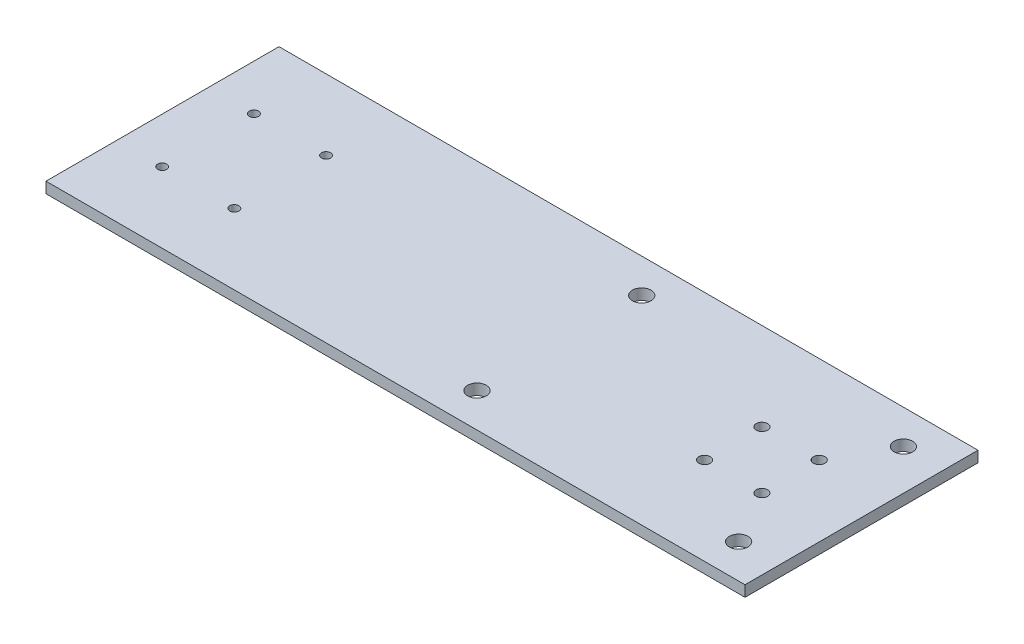
ISO-10303-21;
HEADER;
FILE_DESCRIPTION(('STEP AP214'),'2;1');
FILE_NAME('part.step','',(''),(''),'','','');
FILE_SCHEMA(('AUTOMOTIVE_DESIGN { 1 0 10303 214 1 1 1 1 }'));
ENDSEC;
DATA;
#1=APPLICATION_CONTEXT('core data for automotive mechanical design processes');
#2=APPLICATION_PROTOCOL_DEFINITION('international standard','automotive_design',2000,#1);
#3=PRODUCT_CONTEXT('',#1,'mechanical');
#4=PRODUCT('Part','Part','',(#3));
#5=PRODUCT_RELATED_PRODUCT_CATEGORY('part','',(#4));
#6=PRODUCT_DEFINITION_FORMATION('','',#4);
#7=PRODUCT_DEFINITION_CONTEXT('part definition',#1,'design');
#8=PRODUCT_DEFINITION('design','',#6,#7);
#9=PRODUCT_DEFINITION_SHAPE('','',#8);
#10=(LENGTH_UNIT() NAMED_UNIT(*) SI_UNIT(.MILLI.,.METRE.));
#11=(NAMED_UNIT(*) PLANE_ANGLE_UNIT() SI_UNIT($,.RADIAN.));
#12=(NAMED_UNIT(*) SI_UNIT($,.STERADIAN.) SOLID_ANGLE_UNIT());
#13=UNCERTAINTY_MEASURE_WITH_UNIT(LENGTH_MEASURE(1.E-05),#10,'distance_accuracy_value','');
#14=(GEOMETRIC_REPRESENTATION_CONTEXT(3) GLOBAL_UNCERTAINTY_ASSIGNED_CONTEXT((#13)) GLOBAL_UNIT_ASSIGNED_CONTEXT((#10,
#11,#12)) REPRESENTATION_CONTEXT('',''));
#15=CARTESIAN_POINT('',(0.,0.,0.));
#16=DIRECTION('',(0.,0.,1.));
#17=DIRECTION('',(1.,0.,0.));
#18=AXIS2_PLACEMENT_3D('',#15,#16,#17);
#19=CARTESIAN_POINT('',(0.,4.7625,0.));
#20=DIRECTION('',(0.,-1.,0.));
#21=DIRECTION('',(0.,0.,-1.));
#22=AXIS2_PLACEMENT_3D('',#19,#20,#21);
#23=PLANE('',#22);
#24=DIRECTION('',(1.,0.,0.));
#25=VECTOR('',#24,1.);
#26=CARTESIAN_POINT('',(304.8,4.7625,-25.4));
#27=LINE('',#26,#25);
#28=CARTESIAN_POINT('',(0.,4.7625,-25.4));
#29=VERTEX_POINT('',#28);
#30=CARTESIAN_POINT('',(304.8,4.7625,-25.4));
#31=VERTEX_POINT('',#30);
#32=EDGE_CURVE('E86',#29,#31,#27,.T.);
#33=ORIENTED_EDGE('',*,*,#32,.T.);
#34=DIRECTION('',(0.,0.,-1.));
#35=VECTOR('',#34,1.);
#36=CARTESIAN_POINT('',(304.8,4.7625,-127.));
#37=LINE('',#36,#35);
#38=CARTESIAN_POINT('',(304.8,4.7625,-127.));
#39=VERTEX_POINT('',#38);
#40=EDGE_CURVE('E81',#31,#39,#37,.T.);
#41=ORIENTED_EDGE('',*,*,#40,.T.);
#42=DIRECTION('',(-1.,0.,0.));
#43=VECTOR('',#42,1.);
#44=CARTESIAN_POINT('',(0.,4.7625,-127.));
#45=LINE('',#44,#43);
#46=CARTESIAN_POINT('',(0.,4.7625,-127.));
#47=VERTEX_POINT('',#46);
#48=EDGE_CURVE('E84',#39,#47,#45,.T.);
#49=ORIENTED_EDGE('',*,*,#48,.T.);
#50=DIRECTION('',(0.,0.,1.));
#51=VECTOR('',#50,1.);
#52=CARTESIAN_POINT('',(0.,4.7625,-25.4));
#53=LINE('',#52,#51);
#54=EDGE_CURVE('E51',#47,#29,#53,.T.);
#55=ORIENTED_EDGE('',*,*,#54,.T.);
#56=EDGE_LOOP('',(#33,#41,#49,#55));
#57=FACE_BOUND('',#56,.T.);
#58=CARTESIAN_POINT('',(248.864414399119,4.7625,-88.7000000000002));
#59=DIRECTION('',(0.,1.,0.));
#60=DIRECTION('',(0.,0.,1.));
#61=AXIS2_PLACEMENT_3D('',#58,#59,#60);
#62=CIRCLE('',#61,2.49999999999995);
#63=CARTESIAN_POINT('',(248.864414399119,4.7625,-86.2000000000002));
#64=VERTEX_POINT('',#63);
#65=EDGE_CURVE('E101',#64,#64,#62,.T.);
#66=ORIENTED_EDGE('',*,*,#65,.F.);
#67=EDGE_LOOP('',(#66));
#68=FACE_BOUND('',#67,.T.);
#69=CARTESIAN_POINT('',(248.864414399121,4.7625,-63.6999999999932));
#70=DIRECTION('',(0.,1.,0.));
#71=DIRECTION('',(0.,0.,1.));
#72=AXIS2_PLACEMENT_3D('',#69,#70,#71);
#73=CIRCLE('',#72,2.49999999999283);
#74=CARTESIAN_POINT('',(248.864414399121,4.7625,-61.2000000000004));
#75=VERTEX_POINT('',#74);
#76=EDGE_CURVE('E116',#75,#75,#73,.T.);
#77=ORIENTED_EDGE('',*,*,#76,.F.);
#78=EDGE_LOOP('',(#77));
#79=FACE_BOUND('',#78,.T.);
#80=CARTESIAN_POINT('',(273.864414399119,4.7625,-63.6999999999998));
#81=DIRECTION('',(0.,1.,0.));
#82=DIRECTION('',(0.,0.,1.));
#83=AXIS2_PLACEMENT_3D('',#80,#81,#82);
#84=CIRCLE('',#83,2.49999999999995);
#85=CARTESIAN_POINT('',(273.864414399119,4.7625,-61.1999999999999));
#86=VERTEX_POINT('',#85);
#87=EDGE_CURVE('E122',#86,#86,#84,.T.);
#88=ORIENTED_EDGE('',*,*,#87,.F.);
#89=EDGE_LOOP('',(#88));
#90=FACE_BOUND('',#89,.T.);
#91=CARTESIAN_POINT('',(273.864414399123,4.7625,-88.6999999999959));
#92=DIRECTION('',(0.,1.,0.));
#93=DIRECTION('',(0.,0.,1.));
#94=AXIS2_PLACEMENT_3D('',#91,#92,#93);
#95=CIRCLE('',#94,2.50000000000428);
#96=CARTESIAN_POINT('',(273.864414399123,4.7625,-86.1999999999916));
#97=VERTEX_POINT('',#96);
#98=EDGE_CURVE('E128',#97,#97,#95,.T.);
#99=ORIENTED_EDGE('',*,*,#98,.F.);
#100=EDGE_LOOP('',(#99));
#101=FACE_BOUND('',#100,.T.);
#102=CARTESIAN_POINT('',(287.143048189962,4.7625,-40.2828125));
#103=DIRECTION('',(0.,1.,0.));
#104=DIRECTION('',(0.,0.,1.));
#105=AXIS2_PLACEMENT_3D('',#102,#103,#104);
#106=CIRCLE('',#105,4.04999999999998);
#107=CARTESIAN_POINT('',(287.143048189962,4.7625,-36.2328125));
#108=VERTEX_POINT('',#107);
#109=EDGE_CURVE('E134',#108,#108,#106,.T.);
#110=ORIENTED_EDGE('',*,*,#109,.F.);
#111=EDGE_LOOP('',(#110));
#112=FACE_BOUND('',#111,.T.);
#113=CARTESIAN_POINT('',(173.042404906379,4.7625,-40.2828125));
#114=DIRECTION('',(0.,1.,0.));
#115=DIRECTION('',(0.,0.,1.));
#116=AXIS2_PLACEMENT_3D('',#113,#114,#115);
#117=CIRCLE('',#116,4.05);
#118=CARTESIAN_POINT('',(173.042404906379,4.7625,-36.2328125));
#119=VERTEX_POINT('',#118);
#120=EDGE_CURVE('E140',#119,#119,#117,.T.);
#121=ORIENTED_EDGE('',*,*,#120,.F.);
#122=EDGE_LOOP('',(#121));
#123=FACE_BOUND('',#122,.T.);
#124=CARTESIAN_POINT('',(173.042404906379,4.7625,-112.1171875));
#125=DIRECTION('',(0.,1.,0.));
#126=DIRECTION('',(0.,0.,1.));
#127=AXIS2_PLACEMENT_3D('',#124,#125,#126);
#128=CIRCLE('',#127,4.04999999999999);
#129=CARTESIAN_POINT('',(173.042404906379,4.7625,-108.0671875));
#130=VERTEX_POINT('',#129);
#131=EDGE_CURVE('E146',#130,#130,#128,.T.);
#132=ORIENTED_EDGE('',*,*,#131,.F.);
#133=EDGE_LOOP('',(#132));
#134=FACE_BOUND('',#133,.T.);
#135=CARTESIAN_POINT('',(287.143048189962,4.7625,-112.1171875));
#136=DIRECTION('',(0.,1.,0.));
#137=DIRECTION('',(0.,0.,1.));
#138=AXIS2_PLACEMENT_3D('',#135,#136,#137);
#139=CIRCLE('',#138,4.05);
#140=CARTESIAN_POINT('',(287.143048189962,4.7625,-108.0671875));
#141=VERTEX_POINT('',#140);
#142=EDGE_CURVE('E152',#141,#141,#139,.T.);
#143=ORIENTED_EDGE('',*,*,#142,.F.);
#144=EDGE_LOOP('',(#143));
#145=FACE_BOUND('',#144,.T.);
#146=CARTESIAN_POINT('',(19.876076597086,4.7625,-56.20004));
#147=DIRECTION('',(0.,1.,0.));
#148=DIRECTION('',(0.,0.,1.));
#149=AXIS2_PLACEMENT_3D('',#146,#147,#148);
#150=CIRCLE('',#149,2.);
#151=CARTESIAN_POINT('',(19.876076597086,4.7625,-54.20004));
#152=VERTEX_POINT('',#151);
#153=EDGE_CURVE('E158',#152,#152,#150,.T.);
#154=ORIENTED_EDGE('',*,*,#153,.F.);
#155=EDGE_LOOP('',(#154));
#156=FACE_BOUND('',#155,.T.);
#157=CARTESIAN_POINT('',(51.3288001481484,4.7625,-56.20004));
#158=DIRECTION('',(0.,1.,0.));
#159=DIRECTION('',(0.,0.,1.));
#160=AXIS2_PLACEMENT_3D('',#157,#158,#159);
#161=CIRCLE('',#160,2.);
#162=CARTESIAN_POINT('',(51.3288001481484,4.7625,-54.20004));
#163=VERTEX_POINT('',#162);
#164=EDGE_CURVE('E164',#163,#163,#161,.T.);
#165=ORIENTED_EDGE('',*,*,#164,.F.);
#166=EDGE_LOOP('',(#165));
#167=FACE_BOUND('',#166,.T.);
#168=CARTESIAN_POINT('',(51.3288001481484,4.7625,-96.19996));
#169=DIRECTION('',(0.,1.,0.));
#170=DIRECTION('',(0.,0.,1.));
#171=AXIS2_PLACEMENT_3D('',#168,#169,#170);
#172=CIRCLE('',#171,2.);
#173=CARTESIAN_POINT('',(51.3288001481484,4.7625,-94.19996));
#174=VERTEX_POINT('',#173);
#175=EDGE_CURVE('E170',#174,#174,#172,.T.);
#176=ORIENTED_EDGE('',*,*,#175,.F.);
#177=EDGE_LOOP('',(#176));
#178=FACE_BOUND('',#177,.T.);
#179=CARTESIAN_POINT('',(19.876076597086,4.7625,-96.19996));
#180=DIRECTION('',(0.,1.,0.));
#181=DIRECTION('',(0.,0.,1.));
#182=AXIS2_PLACEMENT_3D('',#179,#180,#181);
#183=CIRCLE('',#182,2.);
#184=CARTESIAN_POINT('',(19.876076597086,4.7625,-94.19996));
#185=VERTEX_POINT('',#184);
#186=EDGE_CURVE('E176',#185,#185,#183,.T.);
#187=ORIENTED_EDGE('',*,*,#186,.F.);
#188=EDGE_LOOP('',(#187));
#189=FACE_BOUND('',#188,.T.);
#190=ADVANCED_FACE('F34',(#57,#68,#79,#90,#101,#112,#123,#134,#145,#156,#167,#178,#189),#23,.F.);
#191=CARTESIAN_POINT('',(0.,0.,0.));
#192=DIRECTION('',(0.,-1.,0.));
#193=DIRECTION('',(0.,0.,-1.));
#194=AXIS2_PLACEMENT_3D('',#191,#192,#193);
#195=PLANE('',#194);
#196=CARTESIAN_POINT('',(51.3288001481484,0.,-96.19996));
#197=DIRECTION('',(0.,1.,0.));
#198=DIRECTION('',(0.,0.,1.));
#199=AXIS2_PLACEMENT_3D('',#196,#197,#198);
#200=CIRCLE('',#199,2.);
#201=CARTESIAN_POINT('',(51.3288001481484,0.,-94.19996));
#202=VERTEX_POINT('',#201);
#203=EDGE_CURVE('E173',#202,#202,#200,.T.);
#204=ORIENTED_EDGE('',*,*,#203,.T.);
#205=EDGE_LOOP('',(#204));
#206=FACE_BOUND('',#205,.T.);
#207=CARTESIAN_POINT('',(19.876076597086,0.,-56.20004));
#208=DIRECTION('',(0.,1.,0.));
#209=DIRECTION('',(0.,0.,1.));
#210=AXIS2_PLACEMENT_3D('',#207,#208,#209);
#211=CIRCLE('',#210,2.);
#212=CARTESIAN_POINT('',(19.876076597086,0.,-54.20004));
#213=VERTEX_POINT('',#212);
#214=EDGE_CURVE('E161',#213,#213,#211,.T.);
#215=ORIENTED_EDGE('',*,*,#214,.T.);
#216=EDGE_LOOP('',(#215));
#217=FACE_BOUND('',#216,.T.);
#218=CARTESIAN_POINT('',(173.042404906379,0.,-112.1171875));
#219=DIRECTION('',(0.,1.,0.));
#220=DIRECTION('',(0.,0.,1.));
#221=AXIS2_PLACEMENT_3D('',#218,#219,#220);
#222=CIRCLE('',#221,4.04999999999999);
#223=CARTESIAN_POINT('',(173.042404906379,0.,-108.0671875));
#224=VERTEX_POINT('',#223);
#225=EDGE_CURVE('E149',#224,#224,#222,.T.);
#226=ORIENTED_EDGE('',*,*,#225,.T.);
#227=EDGE_LOOP('',(#226));
#228=FACE_BOUND('',#227,.T.);
#229=CARTESIAN_POINT('',(287.143048189962,0.,-40.2828125));
#230=DIRECTION('',(0.,1.,0.));
#231=DIRECTION('',(0.,0.,1.));
#232=AXIS2_PLACEMENT_3D('',#229,#230,#231);
#233=CIRCLE('',#232,4.04999999999998);
#234=CARTESIAN_POINT('',(287.143048189962,0.,-36.2328125));
#235=VERTEX_POINT('',#234);
#236=EDGE_CURVE('E137',#235,#235,#233,.T.);
#237=ORIENTED_EDGE('',*,*,#236,.T.);
#238=EDGE_LOOP('',(#237));
#239=FACE_BOUND('',#238,.T.);
#240=CARTESIAN_POINT('',(273.864414399119,0.,-63.6999999999998));
#241=DIRECTION('',(0.,1.,0.));
#242=DIRECTION('',(0.,0.,1.));
#243=AXIS2_PLACEMENT_3D('',#240,#241,#242);
#244=CIRCLE('',#243,2.49999999999995);
#245=CARTESIAN_POINT('',(273.864414399119,0.,-61.1999999999999));
#246=VERTEX_POINT('',#245);
#247=EDGE_CURVE('E125',#246,#246,#244,.T.);
#248=ORIENTED_EDGE('',*,*,#247,.T.);
#249=EDGE_LOOP('',(#248));
#250=FACE_BOUND('',#249,.T.);
#251=CARTESIAN_POINT('',(248.864414399119,0.,-88.7000000000002));
#252=DIRECTION('',(0.,1.,0.));
#253=DIRECTION('',(0.,0.,1.));
#254=AXIS2_PLACEMENT_3D('',#251,#252,#253);
#255=CIRCLE('',#254,2.49999999999995);
#256=CARTESIAN_POINT('',(248.864414399119,0.,-86.2000000000002));
#257=VERTEX_POINT('',#256);
#258=EDGE_CURVE('E113',#257,#257,#255,.T.);
#259=ORIENTED_EDGE('',*,*,#258,.T.);
#260=EDGE_LOOP('',(#259));
#261=FACE_BOUND('',#260,.T.);
#262=DIRECTION('',(1.,0.,0.));
#263=VECTOR('',#262,1.);
#264=CARTESIAN_POINT('',(304.8,0.,-25.4));
#265=LINE('',#264,#263);
#266=CARTESIAN_POINT('',(0.,0.,-25.4));
#267=VERTEX_POINT('',#266);
#268=CARTESIAN_POINT('',(304.8,0.,-25.4));
#269=VERTEX_POINT('',#268);
#270=EDGE_CURVE('E98',#267,#269,#265,.T.);
#271=ORIENTED_EDGE('',*,*,#270,.F.);
#272=DIRECTION('',(0.,0.,1.));
#273=VECTOR('',#272,1.);
#274=CARTESIAN_POINT('',(0.,0.,-25.4));
#275=LINE('',#274,#273);
#276=CARTESIAN_POINT('',(0.,0.,-127.));
#277=VERTEX_POINT('',#276);
#278=EDGE_CURVE('E74',#277,#267,#275,.T.);
#279=ORIENTED_EDGE('',*,*,#278,.F.);
#280=DIRECTION('',(-1.,0.,0.));
#281=VECTOR('',#280,1.);
#282=CARTESIAN_POINT('',(0.,0.,-127.));
#283=LINE('',#282,#281);
#284=CARTESIAN_POINT('',(304.8,0.,-127.));
#285=VERTEX_POINT('',#284);
#286=EDGE_CURVE('E68',#285,#277,#283,.T.);
#287=ORIENTED_EDGE('',*,*,#286,.F.);
#288=DIRECTION('',(0.,0.,-1.));
#289=VECTOR('',#288,1.);
#290=CARTESIAN_POINT('',(304.8,0.,-127.));
#291=LINE('',#290,#289);
#292=EDGE_CURVE('E90',#269,#285,#291,.T.);
#293=ORIENTED_EDGE('',*,*,#292,.F.);
#294=EDGE_LOOP('',(#271,#279,#287,#293));
#295=FACE_BOUND('',#294,.T.);
#296=CARTESIAN_POINT('',(248.864414399121,0.,-63.6999999999932));
#297=DIRECTION('',(0.,1.,0.));
#298=DIRECTION('',(0.,0.,1.));
#299=AXIS2_PLACEMENT_3D('',#296,#297,#298);
#300=CIRCLE('',#299,2.49999999999283);
#301=CARTESIAN_POINT('',(248.864414399121,0.,-61.2000000000004));
#302=VERTEX_POINT('',#301);
#303=EDGE_CURVE('E119',#302,#302,#300,.T.);
#304=ORIENTED_EDGE('',*,*,#303,.T.);
#305=EDGE_LOOP('',(#304));
#306=FACE_BOUND('',#305,.T.);
#307=CARTESIAN_POINT('',(273.864414399123,0.,-88.6999999999959));
#308=DIRECTION('',(0.,1.,0.));
#309=DIRECTION('',(0.,0.,1.));
#310=AXIS2_PLACEMENT_3D('',#307,#308,#309);
#311=CIRCLE('',#310,2.50000000000428);
#312=CARTESIAN_POINT('',(273.864414399123,0.,-86.1999999999916));
#313=VERTEX_POINT('',#312);
#314=EDGE_CURVE('E131',#313,#313,#311,.T.);
#315=ORIENTED_EDGE('',*,*,#314,.T.);
#316=EDGE_LOOP('',(#315));
#317=FACE_BOUND('',#316,.T.);
#318=CARTESIAN_POINT('',(173.042404906379,0.,-40.2828125));
#319=DIRECTION('',(0.,1.,0.));
#320=DIRECTION('',(0.,0.,1.));
#321=AXIS2_PLACEMENT_3D('',#318,#319,#320);
#322=CIRCLE('',#321,4.05);
#323=CARTESIAN_POINT('',(173.042404906379,0.,-36.2328125));
#324=VERTEX_POINT('',#323);
#325=EDGE_CURVE('E143',#324,#324,#322,.T.);
#326=ORIENTED_EDGE('',*,*,#325,.T.);
#327=EDGE_LOOP('',(#326));
#328=FACE_BOUND('',#327,.T.);
#329=CARTESIAN_POINT('',(287.143048189962,0.,-112.1171875));
#330=DIRECTION('',(0.,1.,0.));
#331=DIRECTION('',(0.,0.,1.));
#332=AXIS2_PLACEMENT_3D('',#329,#330,#331);
#333=CIRCLE('',#332,4.05);
#334=CARTESIAN_POINT('',(287.143048189962,0.,-108.0671875));
#335=VERTEX_POINT('',#334);
#336=EDGE_CURVE('E155',#335,#335,#333,.T.);
#337=ORIENTED_EDGE('',*,*,#336,.T.);
#338=EDGE_LOOP('',(#337));
#339=FACE_BOUND('',#338,.T.);
#340=CARTESIAN_POINT('',(51.3288001481484,0.,-56.20004));
#341=DIRECTION('',(0.,1.,0.));
#342=DIRECTION('',(0.,0.,1.));
#343=AXIS2_PLACEMENT_3D('',#340,#341,#342);
#344=CIRCLE('',#343,2.);
#345=CARTESIAN_POINT('',(51.3288001481484,0.,-54.20004));
#346=VERTEX_POINT('',#345);
#347=EDGE_CURVE('E167',#346,#346,#344,.T.);
#348=ORIENTED_EDGE('',*,*,#347,.T.);
#349=EDGE_LOOP('',(#348));
#350=FACE_BOUND('',#349,.T.);
#351=CARTESIAN_POINT('',(19.876076597086,0.,-96.19996));
#352=DIRECTION('',(0.,1.,0.));
#353=DIRECTION('',(0.,0.,1.));
#354=AXIS2_PLACEMENT_3D('',#351,#352,#353);
#355=CIRCLE('',#354,2.);
#356=CARTESIAN_POINT('',(19.876076597086,0.,-94.19996));
#357=VERTEX_POINT('',#356);
#358=EDGE_CURVE('E179',#357,#357,#355,.T.);
#359=ORIENTED_EDGE('',*,*,#358,.T.);
#360=EDGE_LOOP('',(#359));
#361=FACE_BOUND('',#360,.T.);
#362=ADVANCED_FACE('F109',(#206,#217,#228,#239,#250,#261,#295,#306,#317,#328,#339,#350,#361),
#195,.T.);
#363=CARTESIAN_POINT('',(304.8,4.7625,-25.4));
#364=DIRECTION('',(0.,0.,-1.));
#365=DIRECTION('',(-1.,0.,0.));
#366=AXIS2_PLACEMENT_3D('',#363,#364,#365);
#367=PLANE('',#366);
#368=ORIENTED_EDGE('',*,*,#270,.T.);
#369=DIRECTION('',(0.,-1.,0.));
#370=VECTOR('',#369,1.);
#371=CARTESIAN_POINT('',(304.8,4.7625,-25.4));
#372=LINE('',#371,#370);
#373=EDGE_CURVE('E11',#31,#269,#372,.T.);
#374=ORIENTED_EDGE('',*,*,#373,.F.);
#375=ORIENTED_EDGE('',*,*,#32,.F.);
#376=DIRECTION('',(0.,-1.,0.));
#377=VECTOR('',#376,1.);
#378=CARTESIAN_POINT('',(0.,4.7625,-25.4));
#379=LINE('',#378,#377);
#380=EDGE_CURVE('E94',#29,#267,#379,.T.);
#381=ORIENTED_EDGE('',*,*,#380,.T.);
#382=EDGE_LOOP('',(#368,#374,#375,#381));
#383=FACE_BOUND('',#382,.T.);
#384=ADVANCED_FACE('F36',(#383),#367,.F.);
#385=CARTESIAN_POINT('',(304.8,4.7625,-127.));
#386=DIRECTION('',(-1.,0.,0.));
#387=DIRECTION('',(0.,0.,1.));
#388=AXIS2_PLACEMENT_3D('',#385,#386,#387);
#389=PLANE('',#388);
#390=ORIENTED_EDGE('',*,*,#292,.T.);
#391=DIRECTION('',(0.,-1.,0.));
#392=VECTOR('',#391,1.);
#393=CARTESIAN_POINT('',(304.8,4.7625,-127.));
#394=LINE('',#393,#392);
#395=EDGE_CURVE('E43',#39,#285,#394,.T.);
#396=ORIENTED_EDGE('',*,*,#395,.F.);
#397=ORIENTED_EDGE('',*,*,#40,.F.);
#398=ORIENTED_EDGE('',*,*,#373,.T.);
#399=EDGE_LOOP('',(#390,#396,#397,#398));
#400=FACE_BOUND('',#399,.T.);
#401=ADVANCED_FACE('F89',(#400),#389,.F.);
#402=CARTESIAN_POINT('',(0.,4.7625,-127.));
#403=DIRECTION('',(0.,0.,1.));
#404=DIRECTION('',(1.,0.,0.));
#405=AXIS2_PLACEMENT_3D('',#402,#403,#404);
#406=PLANE('',#405);
#407=ORIENTED_EDGE('',*,*,#286,.T.);
#408=DIRECTION('',(0.,-1.,0.));
#409=VECTOR('',#408,1.);
#410=CARTESIAN_POINT('',(0.,4.7625,-127.));
#411=LINE('',#410,#409);
#412=EDGE_CURVE('E91',#47,#277,#411,.T.);
#413=ORIENTED_EDGE('',*,*,#412,.F.);
#414=ORIENTED_EDGE('',*,*,#48,.F.);
#415=ORIENTED_EDGE('',*,*,#395,.T.);
#416=EDGE_LOOP('',(#407,#413,#414,#415));
#417=FACE_BOUND('',#416,.T.);
#418=ADVANCED_FACE('F92',(#417),#406,.F.);
#419=CARTESIAN_POINT('',(0.,4.7625,-25.4));
#420=DIRECTION('',(1.,0.,0.));
#421=DIRECTION('',(0.,0.,-1.));
#422=AXIS2_PLACEMENT_3D('',#419,#420,#421);
#423=PLANE('',#422);
#424=ORIENTED_EDGE('',*,*,#278,.T.);
#425=ORIENTED_EDGE('',*,*,#380,.F.);
#426=ORIENTED_EDGE('',*,*,#54,.F.);
#427=ORIENTED_EDGE('',*,*,#412,.T.);
#428=EDGE_LOOP('',(#424,#425,#426,#427));
#429=FACE_BOUND('',#428,.T.);
#430=ADVANCED_FACE('F106',(#429),#423,.F.);
#431=CARTESIAN_POINT('',(248.864414399119,4.7625,-88.7000000000002));
#432=DIRECTION('',(0.,-1.,0.));
#433=DIRECTION('',(0.,0.,-1.));
#434=AXIS2_PLACEMENT_3D('',#431,#432,#433);
#435=CYLINDRICAL_SURFACE('',#434,2.49999999999995);
#436=ORIENTED_EDGE('',*,*,#65,.T.);
#437=EDGE_LOOP('',(#436));
#438=FACE_BOUND('',#437,.T.);
#439=ORIENTED_EDGE('',*,*,#258,.F.);
#440=EDGE_LOOP('',(#439));
#441=FACE_BOUND('',#440,.T.);
#442=ADVANCED_FACE('F196',(#438,#441),#435,.F.);
#443=CARTESIAN_POINT('',(248.864414399121,4.7625,-63.6999999999932));
#444=DIRECTION('',(0.,-1.,0.));
#445=DIRECTION('',(0.,0.,-1.));
#446=AXIS2_PLACEMENT_3D('',#443,#444,#445);
#447=CYLINDRICAL_SURFACE('',#446,2.49999999999283);
#448=ORIENTED_EDGE('',*,*,#76,.T.);
#449=EDGE_LOOP('',(#448));
#450=FACE_BOUND('',#449,.T.);
#451=ORIENTED_EDGE('',*,*,#303,.F.);
#452=EDGE_LOOP('',(#451));
#453=FACE_BOUND('',#452,.T.);
#454=ADVANCED_FACE('F242',(#450,#453),#447,.F.);
#455=CARTESIAN_POINT('',(273.864414399119,4.7625,-63.6999999999998));
#456=DIRECTION('',(0.,-1.,0.));
#457=DIRECTION('',(0.,0.,-1.));
#458=AXIS2_PLACEMENT_3D('',#455,#456,#457);
#459=CYLINDRICAL_SURFACE('',#458,2.49999999999995);
#460=ORIENTED_EDGE('',*,*,#87,.T.);
#461=EDGE_LOOP('',(#460));
#462=FACE_BOUND('',#461,.T.);
#463=ORIENTED_EDGE('',*,*,#247,.F.);
#464=EDGE_LOOP('',(#463));
#465=FACE_BOUND('',#464,.T.);
#466=ADVANCED_FACE('F250',(#462,#465),#459,.F.);
#467=CARTESIAN_POINT('',(273.864414399123,4.7625,-88.6999999999959));
#468=DIRECTION('',(0.,-1.,0.));
#469=DIRECTION('',(0.,0.,-1.));
#470=AXIS2_PLACEMENT_3D('',#467,#468,#469);
#471=CYLINDRICAL_SURFACE('',#470,2.50000000000428);
#472=ORIENTED_EDGE('',*,*,#98,.T.);
#473=EDGE_LOOP('',(#472));
#474=FACE_BOUND('',#473,.T.);
#475=ORIENTED_EDGE('',*,*,#314,.F.);
#476=EDGE_LOOP('',(#475));
#477=FACE_BOUND('',#476,.T.);
#478=ADVANCED_FACE('F258',(#474,#477),#471,.F.);
#479=CARTESIAN_POINT('',(287.143048189962,4.7625,-40.2828125));
#480=DIRECTION('',(0.,-1.,0.));
#481=DIRECTION('',(0.,0.,-1.));
#482=AXIS2_PLACEMENT_3D('',#479,#480,#481);
#483=CYLINDRICAL_SURFACE('',#482,4.04999999999998);
#484=ORIENTED_EDGE('',*,*,#109,.T.);
#485=EDGE_LOOP('',(#484));
#486=FACE_BOUND('',#485,.T.);
#487=ORIENTED_EDGE('',*,*,#236,.F.);
#488=EDGE_LOOP('',(#487));
#489=FACE_BOUND('',#488,.T.);
#490=ADVANCED_FACE('F267',(#486,#489),#483,.F.);
#491=CARTESIAN_POINT('',(173.042404906379,4.7625,-40.2828125));
#492=DIRECTION('',(0.,-1.,0.));
#493=DIRECTION('',(0.,0.,-1.));
#494=AXIS2_PLACEMENT_3D('',#491,#492,#493);
#495=CYLINDRICAL_SURFACE('',#494,4.05);
#496=ORIENTED_EDGE('',*,*,#120,.T.);
#497=EDGE_LOOP('',(#496));
#498=FACE_BOUND('',#497,.T.);
#499=ORIENTED_EDGE('',*,*,#325,.F.);
#500=EDGE_LOOP('',(#499));
#501=FACE_BOUND('',#500,.T.);
#502=ADVANCED_FACE('F276',(#498,#501),#495,.F.);
#503=CARTESIAN_POINT('',(173.042404906379,4.7625,-112.1171875));
#504=DIRECTION('',(0.,-1.,0.));
#505=DIRECTION('',(0.,0.,-1.));
#506=AXIS2_PLACEMENT_3D('',#503,#504,#505);
#507=CYLINDRICAL_SURFACE('',#506,4.04999999999999);
#508=ORIENTED_EDGE('',*,*,#131,.T.);
#509=EDGE_LOOP('',(#508));
#510=FACE_BOUND('',#509,.T.);
#511=ORIENTED_EDGE('',*,*,#225,.F.);
#512=EDGE_LOOP('',(#511));
#513=FACE_BOUND('',#512,.T.);
#514=ADVANCED_FACE('F285',(#510,#513),#507,.F.);
#515=CARTESIAN_POINT('',(287.143048189962,4.7625,-112.1171875));
#516=DIRECTION('',(0.,-1.,0.));
#517=DIRECTION('',(0.,0.,-1.));
#518=AXIS2_PLACEMENT_3D('',#515,#516,#517);
#519=CYLINDRICAL_SURFACE('',#518,4.05);
#520=ORIENTED_EDGE('',*,*,#142,.T.);
#521=EDGE_LOOP('',(#520));
#522=FACE_BOUND('',#521,.T.);
#523=ORIENTED_EDGE('',*,*,#336,.F.);
#524=EDGE_LOOP('',(#523));
#525=FACE_BOUND('',#524,.T.);
#526=ADVANCED_FACE('F294',(#522,#525),#519,.F.);
#527=CARTESIAN_POINT('',(19.876076597086,4.7625,-56.20004));
#528=DIRECTION('',(0.,-1.,0.));
#529=DIRECTION('',(0.,0.,-1.));
#530=AXIS2_PLACEMENT_3D('',#527,#528,#529);
#531=CYLINDRICAL_SURFACE('',#530,2.);
#532=ORIENTED_EDGE('',*,*,#153,.T.);
#533=EDGE_LOOP('',(#532));
#534=FACE_BOUND('',#533,.T.);
#535=ORIENTED_EDGE('',*,*,#214,.F.);
#536=EDGE_LOOP('',(#535));
#537=FACE_BOUND('',#536,.T.);
#538=ADVANCED_FACE('F303',(#534,#537),#531,.F.);
#539=CARTESIAN_POINT('',(51.3288001481484,4.7625,-56.20004));
#540=DIRECTION('',(0.,-1.,0.));
#541=DIRECTION('',(0.,0.,-1.));
#542=AXIS2_PLACEMENT_3D('',#539,#540,#541);
#543=CYLINDRICAL_SURFACE('',#542,2.);
#544=ORIENTED_EDGE('',*,*,#164,.T.);
#545=EDGE_LOOP('',(#544));
#546=FACE_BOUND('',#545,.T.);
#547=ORIENTED_EDGE('',*,*,#347,.F.);
#548=EDGE_LOOP('',(#547));
#549=FACE_BOUND('',#548,.T.);
#550=ADVANCED_FACE('F312',(#546,#549),#543,.F.);
#551=CARTESIAN_POINT('',(51.3288001481484,4.7625,-96.19996));
#552=DIRECTION('',(0.,-1.,0.));
#553=DIRECTION('',(0.,0.,-1.));
#554=AXIS2_PLACEMENT_3D('',#551,#552,#553);
#555=CYLINDRICAL_SURFACE('',#554,2.);
#556=ORIENTED_EDGE('',*,*,#175,.T.);
#557=EDGE_LOOP('',(#556));
#558=FACE_BOUND('',#557,.T.);
#559=ORIENTED_EDGE('',*,*,#203,.F.);
#560=EDGE_LOOP('',(#559));
#561=FACE_BOUND('',#560,.T.);
#562=ADVANCED_FACE('F321',(#558,#561),#555,.F.);
#563=CARTESIAN_POINT('',(19.876076597086,4.7625,-96.19996));
#564=DIRECTION('',(0.,-1.,0.));
#565=DIRECTION('',(0.,0.,-1.));
#566=AXIS2_PLACEMENT_3D('',#563,#564,#565);
#567=CYLINDRICAL_SURFACE('',#566,2.);
#568=ORIENTED_EDGE('',*,*,#186,.T.);
#569=EDGE_LOOP('',(#568));
#570=FACE_BOUND('',#569,.T.);
#571=ORIENTED_EDGE('',*,*,#358,.F.);
#572=EDGE_LOOP('',(#571));
#573=FACE_BOUND('',#572,.T.);
#574=ADVANCED_FACE('F185',(#570,#573),#567,.F.);
#575=CLOSED_SHELL('',(#190,#362,#384,#401,#418,#430,#442,#454,#466,#478,#490,#502,#514,#526,
#538,#550,#562,#574));
#576=MANIFOLD_SOLID_BREP('B2',#575);
#577=ADVANCED_BREP_SHAPE_REPRESENTATION('',(#18,#576),#14);
#578=SHAPE_DEFINITION_REPRESENTATION(#9,#577);
ENDSEC;
END-ISO-10303-21;
